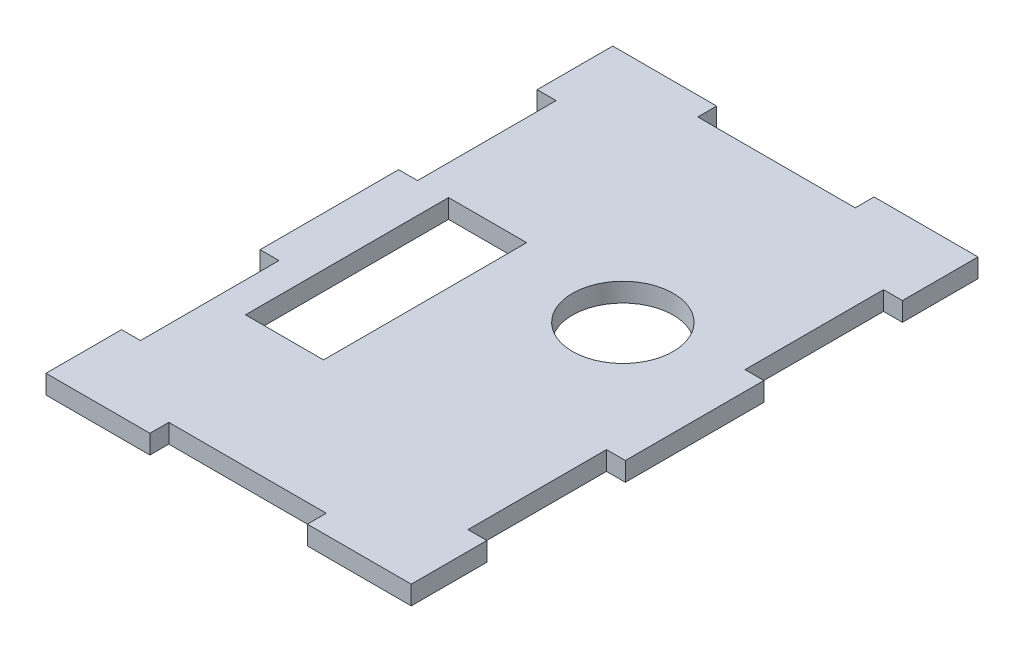
ISO-10303-21;
HEADER;
FILE_DESCRIPTION(('STEP AP214'),'2;1');
FILE_NAME('part.step','',(''),(''),'','','');
FILE_SCHEMA(('AUTOMOTIVE_DESIGN { 1 0 10303 214 1 1 1 1 }'));
ENDSEC;
DATA;
#1=APPLICATION_CONTEXT('core data for automotive mechanical design processes');
#2=APPLICATION_PROTOCOL_DEFINITION('international standard','automotive_design',2000,#1);
#3=PRODUCT_CONTEXT('',#1,'mechanical');
#4=PRODUCT('Part','Part','',(#3));
#5=PRODUCT_RELATED_PRODUCT_CATEGORY('part','',(#4));
#6=PRODUCT_DEFINITION_FORMATION('','',#4);
#7=PRODUCT_DEFINITION_CONTEXT('part definition',#1,'design');
#8=PRODUCT_DEFINITION('design','',#6,#7);
#9=PRODUCT_DEFINITION_SHAPE('','',#8);
#10=(LENGTH_UNIT() NAMED_UNIT(*) SI_UNIT(.MILLI.,.METRE.));
#11=(NAMED_UNIT(*) PLANE_ANGLE_UNIT() SI_UNIT($,.RADIAN.));
#12=(NAMED_UNIT(*) SI_UNIT($,.STERADIAN.) SOLID_ANGLE_UNIT());
#13=UNCERTAINTY_MEASURE_WITH_UNIT(LENGTH_MEASURE(1.E-05),#10,'distance_accuracy_value','');
#14=(GEOMETRIC_REPRESENTATION_CONTEXT(3) GLOBAL_UNCERTAINTY_ASSIGNED_CONTEXT((#13)) GLOBAL_UNIT_ASSIGNED_CONTEXT((#10,
#11,#12)) REPRESENTATION_CONTEXT('',''));
#15=CARTESIAN_POINT('',(0.,0.,0.));
#16=DIRECTION('',(0.,0.,1.));
#17=DIRECTION('',(1.,0.,0.));
#18=AXIS2_PLACEMENT_3D('',#15,#16,#17);
#19=CARTESIAN_POINT('',(0.,3.,0.));
#20=DIRECTION('',(0.,-1.,0.));
#21=DIRECTION('',(0.,0.,-1.));
#22=AXIS2_PLACEMENT_3D('',#19,#20,#21);
#23=PLANE('',#22);
#24=DIRECTION('',(1.,0.,0.));
#25=VECTOR('',#24,1.);
#26=CARTESIAN_POINT('',(-26.,3.,12.));
#27=LINE('',#26,#25);
#28=CARTESIAN_POINT('',(-26.,3.,12.));
#29=VERTEX_POINT('',#28);
#30=CARTESIAN_POINT('',(-23.,3.,12.));
#31=VERTEX_POINT('',#30);
#32=EDGE_CURVE('E281',#29,#31,#27,.T.);
#33=ORIENTED_EDGE('',*,*,#32,.T.);
#34=DIRECTION('',(0.,0.,1.));
#35=VECTOR('',#34,1.);
#36=CARTESIAN_POINT('',(-23.,3.,12.));
#37=LINE('',#36,#35);
#38=CARTESIAN_POINT('',(-23.,3.,34.));
#39=VERTEX_POINT('',#38);
#40=EDGE_CURVE('E284',#31,#39,#37,.T.);
#41=ORIENTED_EDGE('',*,*,#40,.T.);
#42=DIRECTION('',(-1.,0.,0.));
#43=VECTOR('',#42,1.);
#44=CARTESIAN_POINT('',(-23.,3.,34.));
#45=LINE('',#44,#43);
#46=CARTESIAN_POINT('',(-26.,3.,34.));
#47=VERTEX_POINT('',#46);
#48=EDGE_CURVE('E287',#39,#47,#45,.T.);
#49=ORIENTED_EDGE('',*,*,#48,.T.);
#50=DIRECTION('',(0.,0.,1.));
#51=VECTOR('',#50,1.);
#52=CARTESIAN_POINT('',(-26.,3.,34.));
#53=LINE('',#52,#51);
#54=CARTESIAN_POINT('',(-26.,3.,56.));
#55=VERTEX_POINT('',#54);
#56=EDGE_CURVE('E289',#47,#55,#53,.T.);
#57=ORIENTED_EDGE('',*,*,#56,.T.);
#58=DIRECTION('',(1.,0.,0.));
#59=VECTOR('',#58,1.);
#60=CARTESIAN_POINT('',(-26.,3.,56.));
#61=LINE('',#60,#59);
#62=CARTESIAN_POINT('',(-23.,3.,56.));
#63=VERTEX_POINT('',#62);
#64=EDGE_CURVE('E291',#55,#63,#61,.T.);
#65=ORIENTED_EDGE('',*,*,#64,.T.);
#66=DIRECTION('',(0.,0.,1.));
#67=VECTOR('',#66,1.);
#68=CARTESIAN_POINT('',(-23.,3.,56.));
#69=LINE('',#68,#67);
#70=CARTESIAN_POINT('',(-23.,3.,78.));
#71=VERTEX_POINT('',#70);
#72=EDGE_CURVE('E293',#63,#71,#69,.T.);
#73=ORIENTED_EDGE('',*,*,#72,.T.);
#74=DIRECTION('',(-1.,0.,0.));
#75=VECTOR('',#74,1.);
#76=CARTESIAN_POINT('',(-23.,3.,78.));
#77=LINE('',#76,#75);
#78=CARTESIAN_POINT('',(-26.,3.,78.));
#79=VERTEX_POINT('',#78);
#80=EDGE_CURVE('E295',#71,#79,#77,.T.);
#81=ORIENTED_EDGE('',*,*,#80,.T.);
#82=DIRECTION('',(0.,0.,1.));
#83=VECTOR('',#82,1.);
#84=CARTESIAN_POINT('',(-26.,3.,78.));
#85=LINE('',#84,#83);
#86=CARTESIAN_POINT('',(-26.,3.,90.));
#87=VERTEX_POINT('',#86);
#88=EDGE_CURVE('E297',#79,#87,#85,.T.);
#89=ORIENTED_EDGE('',*,*,#88,.T.);
#90=DIRECTION('',(1.,0.,0.));
#91=VECTOR('',#90,1.);
#92=CARTESIAN_POINT('',(-26.,3.,90.));
#93=LINE('',#92,#91);
#94=CARTESIAN_POINT('',(-9.49999999999999,3.,90.));
#95=VERTEX_POINT('',#94);
#96=EDGE_CURVE('E299',#87,#95,#93,.T.);
#97=ORIENTED_EDGE('',*,*,#96,.T.);
#98=DIRECTION('',(0.,0.,-1.));
#99=VECTOR('',#98,1.);
#100=CARTESIAN_POINT('',(-9.49999999999999,3.,90.));
#101=LINE('',#100,#99);
#102=CARTESIAN_POINT('',(-9.5,3.,87.));
#103=VERTEX_POINT('',#102);
#104=EDGE_CURVE('E301',#95,#103,#101,.T.);
#105=ORIENTED_EDGE('',*,*,#104,.T.);
#106=DIRECTION('',(1.,0.,0.));
#107=VECTOR('',#106,1.);
#108=CARTESIAN_POINT('',(-9.5,3.,87.));
#109=LINE('',#108,#107);
#110=CARTESIAN_POINT('',(15.5,3.,87.));
#111=VERTEX_POINT('',#110);
#112=EDGE_CURVE('E303',#103,#111,#109,.T.);
#113=ORIENTED_EDGE('',*,*,#112,.T.);
#114=DIRECTION('',(0.,0.,1.));
#115=VECTOR('',#114,1.);
#116=CARTESIAN_POINT('',(15.5,3.,87.));
#117=LINE('',#116,#115);
#118=CARTESIAN_POINT('',(15.5,3.,90.));
#119=VERTEX_POINT('',#118);
#120=EDGE_CURVE('E305',#111,#119,#117,.T.);
#121=ORIENTED_EDGE('',*,*,#120,.T.);
#122=DIRECTION('',(1.,0.,0.));
#123=VECTOR('',#122,1.);
#124=CARTESIAN_POINT('',(15.5,3.,90.));
#125=LINE('',#124,#123);
#126=CARTESIAN_POINT('',(32.,3.,90.));
#127=VERTEX_POINT('',#126);
#128=EDGE_CURVE('E307',#119,#127,#125,.T.);
#129=ORIENTED_EDGE('',*,*,#128,.T.);
#130=DIRECTION('',(0.,0.,-1.));
#131=VECTOR('',#130,1.);
#132=CARTESIAN_POINT('',(32.,3.,78.));
#133=LINE('',#132,#131);
#134=CARTESIAN_POINT('',(32.,3.,78.));
#135=VERTEX_POINT('',#134);
#136=EDGE_CURVE('E309',#127,#135,#133,.T.);
#137=ORIENTED_EDGE('',*,*,#136,.T.);
#138=DIRECTION('',(-1.,0.,0.));
#139=VECTOR('',#138,1.);
#140=CARTESIAN_POINT('',(32.,3.,78.));
#141=LINE('',#140,#139);
#142=CARTESIAN_POINT('',(29.,3.,78.));
#143=VERTEX_POINT('',#142);
#144=EDGE_CURVE('E311',#135,#143,#141,.T.);
#145=ORIENTED_EDGE('',*,*,#144,.T.);
#146=DIRECTION('',(0.,0.,-1.));
#147=VECTOR('',#146,1.);
#148=CARTESIAN_POINT('',(29.,3.,78.));
#149=LINE('',#148,#147);
#150=CARTESIAN_POINT('',(29.,3.,56.));
#151=VERTEX_POINT('',#150);
#152=EDGE_CURVE('E313',#143,#151,#149,.T.);
#153=ORIENTED_EDGE('',*,*,#152,.T.);
#154=DIRECTION('',(1.,0.,0.));
#155=VECTOR('',#154,1.);
#156=CARTESIAN_POINT('',(29.,3.,56.));
#157=LINE('',#156,#155);
#158=CARTESIAN_POINT('',(32.,3.,56.));
#159=VERTEX_POINT('',#158);
#160=EDGE_CURVE('E315',#151,#159,#157,.T.);
#161=ORIENTED_EDGE('',*,*,#160,.T.);
#162=DIRECTION('',(0.,0.,-1.));
#163=VECTOR('',#162,1.);
#164=CARTESIAN_POINT('',(32.,3.,34.));
#165=LINE('',#164,#163);
#166=CARTESIAN_POINT('',(32.,3.,34.));
#167=VERTEX_POINT('',#166);
#168=EDGE_CURVE('E317',#159,#167,#165,.T.);
#169=ORIENTED_EDGE('',*,*,#168,.T.);
#170=DIRECTION('',(-1.,0.,0.));
#171=VECTOR('',#170,1.);
#172=CARTESIAN_POINT('',(29.,3.,34.));
#173=LINE('',#172,#171);
#174=CARTESIAN_POINT('',(29.,3.,34.));
#175=VERTEX_POINT('',#174);
#176=EDGE_CURVE('E319',#167,#175,#173,.T.);
#177=ORIENTED_EDGE('',*,*,#176,.T.);
#178=DIRECTION('',(0.,0.,-1.));
#179=VECTOR('',#178,1.);
#180=CARTESIAN_POINT('',(29.,3.,12.));
#181=LINE('',#180,#179);
#182=CARTESIAN_POINT('',(29.,3.,12.));
#183=VERTEX_POINT('',#182);
#184=EDGE_CURVE('E321',#175,#183,#181,.T.);
#185=ORIENTED_EDGE('',*,*,#184,.T.);
#186=DIRECTION('',(1.,0.,0.));
#187=VECTOR('',#186,1.);
#188=CARTESIAN_POINT('',(32.,3.,12.));
#189=LINE('',#188,#187);
#190=CARTESIAN_POINT('',(32.,3.,12.));
#191=VERTEX_POINT('',#190);
#192=EDGE_CURVE('E323',#183,#191,#189,.T.);
#193=ORIENTED_EDGE('',*,*,#192,.T.);
#194=DIRECTION('',(0.,0.,-1.));
#195=VECTOR('',#194,1.);
#196=CARTESIAN_POINT('',(32.,3.,0.));
#197=LINE('',#196,#195);
#198=CARTESIAN_POINT('',(32.,3.,0.));
#199=VERTEX_POINT('',#198);
#200=EDGE_CURVE('E325',#191,#199,#197,.T.);
#201=ORIENTED_EDGE('',*,*,#200,.T.);
#202=DIRECTION('',(-1.,0.,0.));
#203=VECTOR('',#202,1.);
#204=CARTESIAN_POINT('',(15.5,3.,0.));
#205=LINE('',#204,#203);
#206=CARTESIAN_POINT('',(15.5,3.,0.));
#207=VERTEX_POINT('',#206);
#208=EDGE_CURVE('E327',#199,#207,#205,.T.);
#209=ORIENTED_EDGE('',*,*,#208,.T.);
#210=DIRECTION('',(0.,0.,1.));
#211=VECTOR('',#210,1.);
#212=CARTESIAN_POINT('',(15.5,3.,3.));
#213=LINE('',#212,#211);
#214=CARTESIAN_POINT('',(15.5,3.,3.));
#215=VERTEX_POINT('',#214);
#216=EDGE_CURVE('E329',#207,#215,#213,.T.);
#217=ORIENTED_EDGE('',*,*,#216,.T.);
#218=DIRECTION('',(-1.,0.,0.));
#219=VECTOR('',#218,1.);
#220=CARTESIAN_POINT('',(-9.5,3.,3.));
#221=LINE('',#220,#219);
#222=CARTESIAN_POINT('',(-9.5,3.,3.));
#223=VERTEX_POINT('',#222);
#224=EDGE_CURVE('E331',#215,#223,#221,.T.);
#225=ORIENTED_EDGE('',*,*,#224,.T.);
#226=DIRECTION('',(0.,0.,-1.));
#227=VECTOR('',#226,1.);
#228=CARTESIAN_POINT('',(-9.5,3.,0.));
#229=LINE('',#228,#227);
#230=CARTESIAN_POINT('',(-9.5,3.,0.));
#231=VERTEX_POINT('',#230);
#232=EDGE_CURVE('E333',#223,#231,#229,.T.);
#233=ORIENTED_EDGE('',*,*,#232,.T.);
#234=DIRECTION('',(-1.,0.,0.));
#235=VECTOR('',#234,1.);
#236=CARTESIAN_POINT('',(-26.,3.,0.));
#237=LINE('',#236,#235);
#238=CARTESIAN_POINT('',(-26.,3.,0.));
#239=VERTEX_POINT('',#238);
#240=EDGE_CURVE('E335',#231,#239,#237,.T.);
#241=ORIENTED_EDGE('',*,*,#240,.T.);
#242=DIRECTION('',(0.,0.,1.));
#243=VECTOR('',#242,1.);
#244=CARTESIAN_POINT('',(-26.,3.,0.));
#245=LINE('',#244,#243);
#246=EDGE_CURVE('E337',#239,#29,#245,.T.);
#247=ORIENTED_EDGE('',*,*,#246,.T.);
#248=EDGE_LOOP('',(#33,#41,#49,#57,#65,#73,#81,#89,#97,#105,#113,#121,#129,#137,#145,#153,#161,
#169,#177,#185,#193,#201,#209,#217,#225,#233,#241,#247));
#249=FACE_BOUND('',#248,.T.);
#250=DIRECTION('',(-1.,0.,0.));
#251=VECTOR('',#250,1.);
#252=CARTESIAN_POINT('',(-18.2,3.,33.875));
#253=LINE('',#252,#251);
#254=CARTESIAN_POINT('',(-5.79999999999999,3.,33.875));
#255=VERTEX_POINT('',#254);
#256=CARTESIAN_POINT('',(-18.2,3.,33.875));
#257=VERTEX_POINT('',#256);
#258=EDGE_CURVE('E242',#255,#257,#253,.T.);
#259=ORIENTED_EDGE('',*,*,#258,.F.);
#260=DIRECTION('',(0.,0.,-1.));
#261=VECTOR('',#260,1.);
#262=CARTESIAN_POINT('',(-5.79999999999999,3.,66.125));
#263=LINE('',#262,#261);
#264=CARTESIAN_POINT('',(-5.79999999999999,3.,66.125));
#265=VERTEX_POINT('',#264);
#266=EDGE_CURVE('E265',#265,#255,#263,.T.);
#267=ORIENTED_EDGE('',*,*,#266,.F.);
#268=DIRECTION('',(1.,0.,0.));
#269=VECTOR('',#268,1.);
#270=CARTESIAN_POINT('',(-18.2,3.,66.125));
#271=LINE('',#270,#269);
#272=CARTESIAN_POINT('',(-18.2,3.,66.125));
#273=VERTEX_POINT('',#272);
#274=EDGE_CURVE('E263',#273,#265,#271,.T.);
#275=ORIENTED_EDGE('',*,*,#274,.F.);
#276=DIRECTION('',(0.,0.,1.));
#277=VECTOR('',#276,1.);
#278=CARTESIAN_POINT('',(-18.2,3.,33.875));
#279=LINE('',#278,#277);
#280=EDGE_CURVE('E250',#257,#273,#279,.T.);
#281=ORIENTED_EDGE('',*,*,#280,.F.);
#282=EDGE_LOOP('',(#259,#267,#275,#281));
#283=FACE_BOUND('',#282,.T.);
#284=CARTESIAN_POINT('',(12.8024192368406,3.,37.2));
#285=DIRECTION('',(0.,1.,0.));
#286=DIRECTION('',(0.,0.,1.));
#287=AXIS2_PLACEMENT_3D('',#284,#285,#286);
#288=CIRCLE('',#287,8.);
#289=CARTESIAN_POINT('',(12.8024192368406,3.,45.2));
#290=VERTEX_POINT('',#289);
#291=EDGE_CURVE('E271',#290,#290,#288,.T.);
#292=ORIENTED_EDGE('',*,*,#291,.F.);
#293=EDGE_LOOP('',(#292));
#294=FACE_BOUND('',#293,.T.);
#295=ADVANCED_FACE('F33',(#249,#283,#294),#23,.F.);
#296=CARTESIAN_POINT('',(0.,0.,0.));
#297=DIRECTION('',(0.,-1.,0.));
#298=DIRECTION('',(0.,0.,-1.));
#299=AXIS2_PLACEMENT_3D('',#296,#297,#298);
#300=PLANE('',#299);
#301=DIRECTION('',(0.,0.,-1.));
#302=VECTOR('',#301,1.);
#303=CARTESIAN_POINT('',(-5.79999999999999,0.,66.125));
#304=LINE('',#303,#302);
#305=CARTESIAN_POINT('',(-5.79999999999999,0.,66.125));
#306=VERTEX_POINT('',#305);
#307=CARTESIAN_POINT('',(-5.79999999999999,0.,33.875));
#308=VERTEX_POINT('',#307);
#309=EDGE_CURVE('E251',#306,#308,#304,.T.);
#310=ORIENTED_EDGE('',*,*,#309,.T.);
#311=DIRECTION('',(-1.,0.,0.));
#312=VECTOR('',#311,1.);
#313=CARTESIAN_POINT('',(-18.2,0.,33.875));
#314=LINE('',#313,#312);
#315=CARTESIAN_POINT('',(-18.2,0.,33.875));
#316=VERTEX_POINT('',#315);
#317=EDGE_CURVE('E56',#308,#316,#314,.T.);
#318=ORIENTED_EDGE('',*,*,#317,.T.);
#319=DIRECTION('',(0.,0.,1.));
#320=VECTOR('',#319,1.);
#321=CARTESIAN_POINT('',(-18.2,0.,33.875));
#322=LINE('',#321,#320);
#323=CARTESIAN_POINT('',(-18.2,0.,66.125));
#324=VERTEX_POINT('',#323);
#325=EDGE_CURVE('E257',#316,#324,#322,.T.);
#326=ORIENTED_EDGE('',*,*,#325,.T.);
#327=DIRECTION('',(1.,0.,0.));
#328=VECTOR('',#327,1.);
#329=CARTESIAN_POINT('',(-18.2,0.,66.125));
#330=LINE('',#329,#328);
#331=EDGE_CURVE('E273',#324,#306,#330,.T.);
#332=ORIENTED_EDGE('',*,*,#331,.T.);
#333=EDGE_LOOP('',(#310,#318,#326,#332));
#334=FACE_BOUND('',#333,.T.);
#335=DIRECTION('',(1.,0.,0.));
#336=VECTOR('',#335,1.);
#337=CARTESIAN_POINT('',(-26.,0.,12.));
#338=LINE('',#337,#336);
#339=CARTESIAN_POINT('',(-26.,0.,12.));
#340=VERTEX_POINT('',#339);
#341=CARTESIAN_POINT('',(-23.,0.,12.));
#342=VERTEX_POINT('',#341);
#343=EDGE_CURVE('E258',#340,#342,#338,.T.);
#344=ORIENTED_EDGE('',*,*,#343,.F.);
#345=DIRECTION('',(0.,0.,1.));
#346=VECTOR('',#345,1.);
#347=CARTESIAN_POINT('',(-26.,0.,0.));
#348=LINE('',#347,#346);
#349=CARTESIAN_POINT('',(-26.,0.,0.));
#350=VERTEX_POINT('',#349);
#351=EDGE_CURVE('E285',#350,#340,#348,.T.);
#352=ORIENTED_EDGE('',*,*,#351,.F.);
#353=DIRECTION('',(-1.,0.,0.));
#354=VECTOR('',#353,1.);
#355=CARTESIAN_POINT('',(-26.,0.,0.));
#356=LINE('',#355,#354);
#357=CARTESIAN_POINT('',(-9.5,0.,0.));
#358=VERTEX_POINT('',#357);
#359=EDGE_CURVE('E392',#358,#350,#356,.T.);
#360=ORIENTED_EDGE('',*,*,#359,.F.);
#361=DIRECTION('',(0.,0.,-1.));
#362=VECTOR('',#361,1.);
#363=CARTESIAN_POINT('',(-9.5,0.,0.));
#364=LINE('',#363,#362);
#365=CARTESIAN_POINT('',(-9.5,0.,3.));
#366=VERTEX_POINT('',#365);
#367=EDGE_CURVE('E390',#366,#358,#364,.T.);
#368=ORIENTED_EDGE('',*,*,#367,.F.);
#369=DIRECTION('',(-1.,0.,0.));
#370=VECTOR('',#369,1.);
#371=CARTESIAN_POINT('',(-9.5,0.,3.));
#372=LINE('',#371,#370);
#373=CARTESIAN_POINT('',(15.5,0.,3.));
#374=VERTEX_POINT('',#373);
#375=EDGE_CURVE('E388',#374,#366,#372,.T.);
#376=ORIENTED_EDGE('',*,*,#375,.F.);
#377=DIRECTION('',(0.,0.,1.));
#378=VECTOR('',#377,1.);
#379=CARTESIAN_POINT('',(15.5,0.,3.));
#380=LINE('',#379,#378);
#381=CARTESIAN_POINT('',(15.5,0.,0.));
#382=VERTEX_POINT('',#381);
#383=EDGE_CURVE('E386',#382,#374,#380,.T.);
#384=ORIENTED_EDGE('',*,*,#383,.F.);
#385=DIRECTION('',(-1.,0.,0.));
#386=VECTOR('',#385,1.);
#387=CARTESIAN_POINT('',(15.5,0.,0.));
#388=LINE('',#387,#386);
#389=CARTESIAN_POINT('',(32.,0.,0.));
#390=VERTEX_POINT('',#389);
#391=EDGE_CURVE('E384',#390,#382,#388,.T.);
#392=ORIENTED_EDGE('',*,*,#391,.F.);
#393=DIRECTION('',(0.,0.,-1.));
#394=VECTOR('',#393,1.);
#395=CARTESIAN_POINT('',(32.,0.,0.));
#396=LINE('',#395,#394);
#397=CARTESIAN_POINT('',(32.,0.,12.));
#398=VERTEX_POINT('',#397);
#399=EDGE_CURVE('E382',#398,#390,#396,.T.);
#400=ORIENTED_EDGE('',*,*,#399,.F.);
#401=DIRECTION('',(1.,0.,0.));
#402=VECTOR('',#401,1.);
#403=CARTESIAN_POINT('',(32.,0.,12.));
#404=LINE('',#403,#402);
#405=CARTESIAN_POINT('',(29.,0.,12.));
#406=VERTEX_POINT('',#405);
#407=EDGE_CURVE('E380',#406,#398,#404,.T.);
#408=ORIENTED_EDGE('',*,*,#407,.F.);
#409=DIRECTION('',(0.,0.,-1.));
#410=VECTOR('',#409,1.);
#411=CARTESIAN_POINT('',(29.,0.,12.));
#412=LINE('',#411,#410);
#413=CARTESIAN_POINT('',(29.,0.,34.));
#414=VERTEX_POINT('',#413);
#415=EDGE_CURVE('E378',#414,#406,#412,.T.);
#416=ORIENTED_EDGE('',*,*,#415,.F.);
#417=DIRECTION('',(-1.,0.,0.));
#418=VECTOR('',#417,1.);
#419=CARTESIAN_POINT('',(29.,0.,34.));
#420=LINE('',#419,#418);
#421=CARTESIAN_POINT('',(32.,0.,34.));
#422=VERTEX_POINT('',#421);
#423=EDGE_CURVE('E376',#422,#414,#420,.T.);
#424=ORIENTED_EDGE('',*,*,#423,.F.);
#425=DIRECTION('',(0.,0.,-1.));
#426=VECTOR('',#425,1.);
#427=CARTESIAN_POINT('',(32.,0.,34.));
#428=LINE('',#427,#426);
#429=CARTESIAN_POINT('',(32.,0.,56.));
#430=VERTEX_POINT('',#429);
#431=EDGE_CURVE('E374',#430,#422,#428,.T.);
#432=ORIENTED_EDGE('',*,*,#431,.F.);
#433=DIRECTION('',(1.,0.,0.));
#434=VECTOR('',#433,1.);
#435=CARTESIAN_POINT('',(29.,0.,56.));
#436=LINE('',#435,#434);
#437=CARTESIAN_POINT('',(29.,0.,56.));
#438=VERTEX_POINT('',#437);
#439=EDGE_CURVE('E372',#438,#430,#436,.T.);
#440=ORIENTED_EDGE('',*,*,#439,.F.);
#441=DIRECTION('',(0.,0.,-1.));
#442=VECTOR('',#441,1.);
#443=CARTESIAN_POINT('',(29.,0.,78.));
#444=LINE('',#443,#442);
#445=CARTESIAN_POINT('',(29.,0.,78.));
#446=VERTEX_POINT('',#445);
#447=EDGE_CURVE('E370',#446,#438,#444,.T.);
#448=ORIENTED_EDGE('',*,*,#447,.F.);
#449=DIRECTION('',(-1.,0.,0.));
#450=VECTOR('',#449,1.);
#451=CARTESIAN_POINT('',(32.,0.,78.));
#452=LINE('',#451,#450);
#453=CARTESIAN_POINT('',(32.,0.,78.));
#454=VERTEX_POINT('',#453);
#455=EDGE_CURVE('E368',#454,#446,#452,.T.);
#456=ORIENTED_EDGE('',*,*,#455,.F.);
#457=DIRECTION('',(0.,0.,-1.));
#458=VECTOR('',#457,1.);
#459=CARTESIAN_POINT('',(32.,0.,78.));
#460=LINE('',#459,#458);
#461=CARTESIAN_POINT('',(32.,0.,90.));
#462=VERTEX_POINT('',#461);
#463=EDGE_CURVE('E366',#462,#454,#460,.T.);
#464=ORIENTED_EDGE('',*,*,#463,.F.);
#465=DIRECTION('',(1.,0.,0.));
#466=VECTOR('',#465,1.);
#467=CARTESIAN_POINT('',(15.5,0.,90.));
#468=LINE('',#467,#466);
#469=CARTESIAN_POINT('',(15.5,0.,90.));
#470=VERTEX_POINT('',#469);
#471=EDGE_CURVE('E364',#470,#462,#468,.T.);
#472=ORIENTED_EDGE('',*,*,#471,.F.);
#473=DIRECTION('',(0.,0.,1.));
#474=VECTOR('',#473,1.);
#475=CARTESIAN_POINT('',(15.5,0.,87.));
#476=LINE('',#475,#474);
#477=CARTESIAN_POINT('',(15.5,0.,87.));
#478=VERTEX_POINT('',#477);
#479=EDGE_CURVE('E362',#478,#470,#476,.T.);
#480=ORIENTED_EDGE('',*,*,#479,.F.);
#481=DIRECTION('',(1.,0.,0.));
#482=VECTOR('',#481,1.);
#483=CARTESIAN_POINT('',(-9.5,0.,87.));
#484=LINE('',#483,#482);
#485=CARTESIAN_POINT('',(-9.5,0.,87.));
#486=VERTEX_POINT('',#485);
#487=EDGE_CURVE('E360',#486,#478,#484,.T.);
#488=ORIENTED_EDGE('',*,*,#487,.F.);
#489=DIRECTION('',(0.,0.,-1.));
#490=VECTOR('',#489,1.);
#491=CARTESIAN_POINT('',(-9.49999999999999,0.,90.));
#492=LINE('',#491,#490);
#493=CARTESIAN_POINT('',(-9.49999999999999,0.,90.));
#494=VERTEX_POINT('',#493);
#495=EDGE_CURVE('E358',#494,#486,#492,.T.);
#496=ORIENTED_EDGE('',*,*,#495,.F.);
#497=DIRECTION('',(1.,0.,0.));
#498=VECTOR('',#497,1.);
#499=CARTESIAN_POINT('',(-26.,0.,90.));
#500=LINE('',#499,#498);
#501=CARTESIAN_POINT('',(-26.,0.,90.));
#502=VERTEX_POINT('',#501);
#503=EDGE_CURVE('E356',#502,#494,#500,.T.);
#504=ORIENTED_EDGE('',*,*,#503,.F.);
#505=DIRECTION('',(0.,0.,1.));
#506=VECTOR('',#505,1.);
#507=CARTESIAN_POINT('',(-26.,0.,78.));
#508=LINE('',#507,#506);
#509=CARTESIAN_POINT('',(-26.,0.,78.));
#510=VERTEX_POINT('',#509);
#511=EDGE_CURVE('E354',#510,#502,#508,.T.);
#512=ORIENTED_EDGE('',*,*,#511,.F.);
#513=DIRECTION('',(-1.,0.,0.));
#514=VECTOR('',#513,1.);
#515=CARTESIAN_POINT('',(-23.,0.,78.));
#516=LINE('',#515,#514);
#517=CARTESIAN_POINT('',(-23.,0.,78.));
#518=VERTEX_POINT('',#517);
#519=EDGE_CURVE('E352',#518,#510,#516,.T.);
#520=ORIENTED_EDGE('',*,*,#519,.F.);
#521=DIRECTION('',(0.,0.,1.));
#522=VECTOR('',#521,1.);
#523=CARTESIAN_POINT('',(-23.,0.,56.));
#524=LINE('',#523,#522);
#525=CARTESIAN_POINT('',(-23.,0.,56.));
#526=VERTEX_POINT('',#525);
#527=EDGE_CURVE('E350',#526,#518,#524,.T.);
#528=ORIENTED_EDGE('',*,*,#527,.F.);
#529=DIRECTION('',(1.,0.,0.));
#530=VECTOR('',#529,1.);
#531=CARTESIAN_POINT('',(-26.,0.,56.));
#532=LINE('',#531,#530);
#533=CARTESIAN_POINT('',(-26.,0.,56.));
#534=VERTEX_POINT('',#533);
#535=EDGE_CURVE('E348',#534,#526,#532,.T.);
#536=ORIENTED_EDGE('',*,*,#535,.F.);
#537=DIRECTION('',(0.,0.,1.));
#538=VECTOR('',#537,1.);
#539=CARTESIAN_POINT('',(-26.,0.,34.));
#540=LINE('',#539,#538);
#541=CARTESIAN_POINT('',(-26.,0.,34.));
#542=VERTEX_POINT('',#541);
#543=EDGE_CURVE('E346',#542,#534,#540,.T.);
#544=ORIENTED_EDGE('',*,*,#543,.F.);
#545=DIRECTION('',(-1.,0.,0.));
#546=VECTOR('',#545,1.);
#547=CARTESIAN_POINT('',(-23.,0.,34.));
#548=LINE('',#547,#546);
#549=CARTESIAN_POINT('',(-23.,0.,34.));
#550=VERTEX_POINT('',#549);
#551=EDGE_CURVE('E344',#550,#542,#548,.T.);
#552=ORIENTED_EDGE('',*,*,#551,.F.);
#553=DIRECTION('',(0.,0.,1.));
#554=VECTOR('',#553,1.);
#555=CARTESIAN_POINT('',(-23.,0.,12.));
#556=LINE('',#555,#554);
#557=EDGE_CURVE('E342',#342,#550,#556,.T.);
#558=ORIENTED_EDGE('',*,*,#557,.F.);
#559=EDGE_LOOP('',(#344,#352,#360,#368,#376,#384,#392,#400,#408,#416,#424,#432,#440,#448,#456,
#464,#472,#480,#488,#496,#504,#512,#520,#528,#536,#544,#552,#558));
#560=FACE_BOUND('',#559,.T.);
#561=CARTESIAN_POINT('',(12.8024192368406,0.,37.2));
#562=DIRECTION('',(0.,1.,0.));
#563=DIRECTION('',(0.,0.,1.));
#564=AXIS2_PLACEMENT_3D('',#561,#562,#563);
#565=CIRCLE('',#564,8.);
#566=CARTESIAN_POINT('',(12.8024192368406,0.,45.2));
#567=VERTEX_POINT('',#566);
#568=EDGE_CURVE('E902',#567,#567,#565,.T.);
#569=ORIENTED_EDGE('',*,*,#568,.T.);
#570=EDGE_LOOP('',(#569));
#571=FACE_BOUND('',#570,.T.);
#572=ADVANCED_FACE('F482',(#334,#560,#571),#300,.T.);
#573=CARTESIAN_POINT('',(-26.,3.,12.));
#574=DIRECTION('',(0.,0.,-1.));
#575=DIRECTION('',(-1.,0.,0.));
#576=AXIS2_PLACEMENT_3D('',#573,#574,#575);
#577=PLANE('',#576);
#578=ORIENTED_EDGE('',*,*,#343,.T.);
#579=DIRECTION('',(0.,-1.,0.));
#580=VECTOR('',#579,1.);
#581=CARTESIAN_POINT('',(-23.,3.,12.));
#582=LINE('',#581,#580);
#583=EDGE_CURVE('E11',#31,#342,#582,.T.);
#584=ORIENTED_EDGE('',*,*,#583,.F.);
#585=ORIENTED_EDGE('',*,*,#32,.F.);
#586=DIRECTION('',(0.,-1.,0.));
#587=VECTOR('',#586,1.);
#588=CARTESIAN_POINT('',(-26.,3.,12.));
#589=LINE('',#588,#587);
#590=EDGE_CURVE('E339',#29,#340,#589,.T.);
#591=ORIENTED_EDGE('',*,*,#590,.T.);
#592=EDGE_LOOP('',(#578,#584,#585,#591));
#593=FACE_BOUND('',#592,.T.);
#594=ADVANCED_FACE('F35',(#593),#577,.F.);
#595=CARTESIAN_POINT('',(-23.,3.,12.));
#596=DIRECTION('',(1.,0.,0.));
#597=DIRECTION('',(0.,0.,-1.));
#598=AXIS2_PLACEMENT_3D('',#595,#596,#597);
#599=PLANE('',#598);
#600=ORIENTED_EDGE('',*,*,#557,.T.);
#601=DIRECTION('',(0.,-1.,0.));
#602=VECTOR('',#601,1.);
#603=CARTESIAN_POINT('',(-23.,3.,34.));
#604=LINE('',#603,#602);
#605=EDGE_CURVE('E41',#39,#550,#604,.T.);
#606=ORIENTED_EDGE('',*,*,#605,.F.);
#607=ORIENTED_EDGE('',*,*,#40,.F.);
#608=ORIENTED_EDGE('',*,*,#583,.T.);
#609=EDGE_LOOP('',(#600,#606,#607,#608));
#610=FACE_BOUND('',#609,.T.);
#611=ADVANCED_FACE('F499',(#610),#599,.F.);
#612=CARTESIAN_POINT('',(-23.,3.,34.));
#613=DIRECTION('',(0.,0.,1.));
#614=DIRECTION('',(1.,0.,0.));
#615=AXIS2_PLACEMENT_3D('',#612,#613,#614);
#616=PLANE('',#615);
#617=ORIENTED_EDGE('',*,*,#551,.T.);
#618=DIRECTION('',(0.,-1.,0.));
#619=VECTOR('',#618,1.);
#620=CARTESIAN_POINT('',(-26.,3.,34.));
#621=LINE('',#620,#619);
#622=EDGE_CURVE('E469',#47,#542,#621,.T.);
#623=ORIENTED_EDGE('',*,*,#622,.F.);
#624=ORIENTED_EDGE('',*,*,#48,.F.);
#625=ORIENTED_EDGE('',*,*,#605,.T.);
#626=EDGE_LOOP('',(#617,#623,#624,#625));
#627=FACE_BOUND('',#626,.T.);
#628=ADVANCED_FACE('F476',(#627),#616,.F.);
#629=CARTESIAN_POINT('',(-26.,3.,34.));
#630=DIRECTION('',(1.,0.,0.));
#631=DIRECTION('',(0.,0.,-1.));
#632=AXIS2_PLACEMENT_3D('',#629,#630,#631);
#633=PLANE('',#632);
#634=ORIENTED_EDGE('',*,*,#543,.T.);
#635=DIRECTION('',(0.,-1.,0.));
#636=VECTOR('',#635,1.);
#637=CARTESIAN_POINT('',(-26.,3.,56.));
#638=LINE('',#637,#636);
#639=EDGE_CURVE('E466',#55,#534,#638,.T.);
#640=ORIENTED_EDGE('',*,*,#639,.F.);
#641=ORIENTED_EDGE('',*,*,#56,.F.);
#642=ORIENTED_EDGE('',*,*,#622,.T.);
#643=EDGE_LOOP('',(#634,#640,#641,#642));
#644=FACE_BOUND('',#643,.T.);
#645=ADVANCED_FACE('F488',(#644),#633,.F.);
#646=CARTESIAN_POINT('',(-26.,3.,56.));
#647=DIRECTION('',(0.,0.,-1.));
#648=DIRECTION('',(-1.,0.,0.));
#649=AXIS2_PLACEMENT_3D('',#646,#647,#648);
#650=PLANE('',#649);
#651=ORIENTED_EDGE('',*,*,#535,.T.);
#652=DIRECTION('',(0.,-1.,0.));
#653=VECTOR('',#652,1.);
#654=CARTESIAN_POINT('',(-23.,3.,56.));
#655=LINE('',#654,#653);
#656=EDGE_CURVE('E463',#63,#526,#655,.T.);
#657=ORIENTED_EDGE('',*,*,#656,.F.);
#658=ORIENTED_EDGE('',*,*,#64,.F.);
#659=ORIENTED_EDGE('',*,*,#639,.T.);
#660=EDGE_LOOP('',(#651,#657,#658,#659));
#661=FACE_BOUND('',#660,.T.);
#662=ADVANCED_FACE('F492',(#661),#650,.F.);
#663=CARTESIAN_POINT('',(-23.,3.,56.));
#664=DIRECTION('',(1.,0.,0.));
#665=DIRECTION('',(0.,0.,-1.));
#666=AXIS2_PLACEMENT_3D('',#663,#664,#665);
#667=PLANE('',#666);
#668=ORIENTED_EDGE('',*,*,#527,.T.);
#669=DIRECTION('',(0.,-1.,0.));
#670=VECTOR('',#669,1.);
#671=CARTESIAN_POINT('',(-23.,3.,78.));
#672=LINE('',#671,#670);
#673=EDGE_CURVE('E460',#71,#518,#672,.T.);
#674=ORIENTED_EDGE('',*,*,#673,.F.);
#675=ORIENTED_EDGE('',*,*,#72,.F.);
#676=ORIENTED_EDGE('',*,*,#656,.T.);
#677=EDGE_LOOP('',(#668,#674,#675,#676));
#678=FACE_BOUND('',#677,.T.);
#679=ADVANCED_FACE('F612',(#678),#667,.F.);
#680=CARTESIAN_POINT('',(-23.,3.,78.));
#681=DIRECTION('',(0.,0.,1.));
#682=DIRECTION('',(1.,0.,0.));
#683=AXIS2_PLACEMENT_3D('',#680,#681,#682);
#684=PLANE('',#683);
#685=ORIENTED_EDGE('',*,*,#519,.T.);
#686=DIRECTION('',(0.,-1.,0.));
#687=VECTOR('',#686,1.);
#688=CARTESIAN_POINT('',(-26.,3.,78.));
#689=LINE('',#688,#687);
#690=EDGE_CURVE('E457',#79,#510,#689,.T.);
#691=ORIENTED_EDGE('',*,*,#690,.F.);
#692=ORIENTED_EDGE('',*,*,#80,.F.);
#693=ORIENTED_EDGE('',*,*,#673,.T.);
#694=EDGE_LOOP('',(#685,#691,#692,#693));
#695=FACE_BOUND('',#694,.T.);
#696=ADVANCED_FACE('F609',(#695),#684,.F.);
#697=CARTESIAN_POINT('',(-26.,3.,78.));
#698=DIRECTION('',(1.,0.,0.));
#699=DIRECTION('',(0.,0.,-1.));
#700=AXIS2_PLACEMENT_3D('',#697,#698,#699);
#701=PLANE('',#700);
#702=ORIENTED_EDGE('',*,*,#511,.T.);
#703=DIRECTION('',(0.,-1.,0.));
#704=VECTOR('',#703,1.);
#705=CARTESIAN_POINT('',(-26.,3.,90.));
#706=LINE('',#705,#704);
#707=EDGE_CURVE('E454',#87,#502,#706,.T.);
#708=ORIENTED_EDGE('',*,*,#707,.F.);
#709=ORIENTED_EDGE('',*,*,#88,.F.);
#710=ORIENTED_EDGE('',*,*,#690,.T.);
#711=EDGE_LOOP('',(#702,#708,#709,#710));
#712=FACE_BOUND('',#711,.T.);
#713=ADVANCED_FACE('F605',(#712),#701,.F.);
#714=CARTESIAN_POINT('',(-26.,3.,90.));
#715=DIRECTION('',(0.,0.,-1.));
#716=DIRECTION('',(-1.,0.,0.));
#717=AXIS2_PLACEMENT_3D('',#714,#715,#716);
#718=PLANE('',#717);
#719=ORIENTED_EDGE('',*,*,#503,.T.);
#720=DIRECTION('',(0.,-1.,0.));
#721=VECTOR('',#720,1.);
#722=CARTESIAN_POINT('',(-9.49999999999999,3.,90.));
#723=LINE('',#722,#721);
#724=EDGE_CURVE('E451',#95,#494,#723,.T.);
#725=ORIENTED_EDGE('',*,*,#724,.F.);
#726=ORIENTED_EDGE('',*,*,#96,.F.);
#727=ORIENTED_EDGE('',*,*,#707,.T.);
#728=EDGE_LOOP('',(#719,#725,#726,#727));
#729=FACE_BOUND('',#728,.T.);
#730=ADVANCED_FACE('F601',(#729),#718,.F.);
#731=CARTESIAN_POINT('',(-9.49999999999999,3.,90.));
#732=DIRECTION('',(-1.,0.,0.));
#733=DIRECTION('',(0.,0.,1.));
#734=AXIS2_PLACEMENT_3D('',#731,#732,#733);
#735=PLANE('',#734);
#736=ORIENTED_EDGE('',*,*,#495,.T.);
#737=DIRECTION('',(0.,-1.,0.));
#738=VECTOR('',#737,1.);
#739=CARTESIAN_POINT('',(-9.5,3.,87.));
#740=LINE('',#739,#738);
#741=EDGE_CURVE('E448',#103,#486,#740,.T.);
#742=ORIENTED_EDGE('',*,*,#741,.F.);
#743=ORIENTED_EDGE('',*,*,#104,.F.);
#744=ORIENTED_EDGE('',*,*,#724,.T.);
#745=EDGE_LOOP('',(#736,#742,#743,#744));
#746=FACE_BOUND('',#745,.T.);
#747=ADVANCED_FACE('F596',(#746),#735,.F.);
#748=CARTESIAN_POINT('',(-9.5,3.,87.));
#749=DIRECTION('',(0.,0.,-1.));
#750=DIRECTION('',(-1.,0.,0.));
#751=AXIS2_PLACEMENT_3D('',#748,#749,#750);
#752=PLANE('',#751);
#753=ORIENTED_EDGE('',*,*,#487,.T.);
#754=DIRECTION('',(0.,-1.,0.));
#755=VECTOR('',#754,1.);
#756=CARTESIAN_POINT('',(15.5,3.,87.));
#757=LINE('',#756,#755);
#758=EDGE_CURVE('E445',#111,#478,#757,.T.);
#759=ORIENTED_EDGE('',*,*,#758,.F.);
#760=ORIENTED_EDGE('',*,*,#112,.F.);
#761=ORIENTED_EDGE('',*,*,#741,.T.);
#762=EDGE_LOOP('',(#753,#759,#760,#761));
#763=FACE_BOUND('',#762,.T.);
#764=ADVANCED_FACE('F590',(#763),#752,.F.);
#765=CARTESIAN_POINT('',(15.5,3.,87.));
#766=DIRECTION('',(1.,0.,0.));
#767=DIRECTION('',(0.,0.,-1.));
#768=AXIS2_PLACEMENT_3D('',#765,#766,#767);
#769=PLANE('',#768);
#770=ORIENTED_EDGE('',*,*,#479,.T.);
#771=DIRECTION('',(0.,-1.,0.));
#772=VECTOR('',#771,1.);
#773=CARTESIAN_POINT('',(15.5,3.,90.));
#774=LINE('',#773,#772);
#775=EDGE_CURVE('E442',#119,#470,#774,.T.);
#776=ORIENTED_EDGE('',*,*,#775,.F.);
#777=ORIENTED_EDGE('',*,*,#120,.F.);
#778=ORIENTED_EDGE('',*,*,#758,.T.);
#779=EDGE_LOOP('',(#770,#776,#777,#778));
#780=FACE_BOUND('',#779,.T.);
#781=ADVANCED_FACE('F586',(#780),#769,.F.);
#782=CARTESIAN_POINT('',(15.5,3.,90.));
#783=DIRECTION('',(0.,0.,-1.));
#784=DIRECTION('',(-1.,0.,0.));
#785=AXIS2_PLACEMENT_3D('',#782,#783,#784);
#786=PLANE('',#785);
#787=ORIENTED_EDGE('',*,*,#471,.T.);
#788=DIRECTION('',(0.,-1.,0.));
#789=VECTOR('',#788,1.);
#790=CARTESIAN_POINT('',(32.,3.,90.));
#791=LINE('',#790,#789);
#792=EDGE_CURVE('E439',#127,#462,#791,.T.);
#793=ORIENTED_EDGE('',*,*,#792,.F.);
#794=ORIENTED_EDGE('',*,*,#128,.F.);
#795=ORIENTED_EDGE('',*,*,#775,.T.);
#796=EDGE_LOOP('',(#787,#793,#794,#795));
#797=FACE_BOUND('',#796,.T.);
#798=ADVANCED_FACE('F581',(#797),#786,.F.);
#799=CARTESIAN_POINT('',(32.,3.,78.));
#800=DIRECTION('',(-1.,0.,0.));
#801=DIRECTION('',(0.,0.,1.));
#802=AXIS2_PLACEMENT_3D('',#799,#800,#801);
#803=PLANE('',#802);
#804=ORIENTED_EDGE('',*,*,#463,.T.);
#805=DIRECTION('',(0.,-1.,0.));
#806=VECTOR('',#805,1.);
#807=CARTESIAN_POINT('',(32.,3.,78.));
#808=LINE('',#807,#806);
#809=EDGE_CURVE('E436',#135,#454,#808,.T.);
#810=ORIENTED_EDGE('',*,*,#809,.F.);
#811=ORIENTED_EDGE('',*,*,#136,.F.);
#812=ORIENTED_EDGE('',*,*,#792,.T.);
#813=EDGE_LOOP('',(#804,#810,#811,#812));
#814=FACE_BOUND('',#813,.T.);
#815=ADVANCED_FACE('F575',(#814),#803,.F.);
#816=CARTESIAN_POINT('',(32.,3.,78.));
#817=DIRECTION('',(0.,0.,1.));
#818=DIRECTION('',(1.,0.,0.));
#819=AXIS2_PLACEMENT_3D('',#816,#817,#818);
#820=PLANE('',#819);
#821=ORIENTED_EDGE('',*,*,#455,.T.);
#822=DIRECTION('',(0.,-1.,0.));
#823=VECTOR('',#822,1.);
#824=CARTESIAN_POINT('',(29.,3.,78.));
#825=LINE('',#824,#823);
#826=EDGE_CURVE('E433',#143,#446,#825,.T.);
#827=ORIENTED_EDGE('',*,*,#826,.F.);
#828=ORIENTED_EDGE('',*,*,#144,.F.);
#829=ORIENTED_EDGE('',*,*,#809,.T.);
#830=EDGE_LOOP('',(#821,#827,#828,#829));
#831=FACE_BOUND('',#830,.T.);
#832=ADVANCED_FACE('F571',(#831),#820,.F.);
#833=CARTESIAN_POINT('',(29.,3.,78.));
#834=DIRECTION('',(-1.,0.,0.));
#835=DIRECTION('',(0.,0.,1.));
#836=AXIS2_PLACEMENT_3D('',#833,#834,#835);
#837=PLANE('',#836);
#838=ORIENTED_EDGE('',*,*,#447,.T.);
#839=DIRECTION('',(0.,-1.,0.));
#840=VECTOR('',#839,1.);
#841=CARTESIAN_POINT('',(29.,3.,56.));
#842=LINE('',#841,#840);
#843=EDGE_CURVE('E430',#151,#438,#842,.T.);
#844=ORIENTED_EDGE('',*,*,#843,.F.);
#845=ORIENTED_EDGE('',*,*,#152,.F.);
#846=ORIENTED_EDGE('',*,*,#826,.T.);
#847=EDGE_LOOP('',(#838,#844,#845,#846));
#848=FACE_BOUND('',#847,.T.);
#849=ADVANCED_FACE('F566',(#848),#837,.F.);
#850=CARTESIAN_POINT('',(29.,3.,56.));
#851=DIRECTION('',(0.,0.,-1.));
#852=DIRECTION('',(-1.,0.,0.));
#853=AXIS2_PLACEMENT_3D('',#850,#851,#852);
#854=PLANE('',#853);
#855=ORIENTED_EDGE('',*,*,#439,.T.);
#856=DIRECTION('',(0.,-1.,0.));
#857=VECTOR('',#856,1.);
#858=CARTESIAN_POINT('',(32.,3.,56.));
#859=LINE('',#858,#857);
#860=EDGE_CURVE('E427',#159,#430,#859,.T.);
#861=ORIENTED_EDGE('',*,*,#860,.F.);
#862=ORIENTED_EDGE('',*,*,#160,.F.);
#863=ORIENTED_EDGE('',*,*,#843,.T.);
#864=EDGE_LOOP('',(#855,#861,#862,#863));
#865=FACE_BOUND('',#864,.T.);
#866=ADVANCED_FACE('F560',(#865),#854,.F.);
#867=CARTESIAN_POINT('',(32.,3.,34.));
#868=DIRECTION('',(-1.,0.,0.));
#869=DIRECTION('',(0.,0.,1.));
#870=AXIS2_PLACEMENT_3D('',#867,#868,#869);
#871=PLANE('',#870);
#872=ORIENTED_EDGE('',*,*,#431,.T.);
#873=DIRECTION('',(0.,-1.,0.));
#874=VECTOR('',#873,1.);
#875=CARTESIAN_POINT('',(32.,3.,34.));
#876=LINE('',#875,#874);
#877=EDGE_CURVE('E424',#167,#422,#876,.T.);
#878=ORIENTED_EDGE('',*,*,#877,.F.);
#879=ORIENTED_EDGE('',*,*,#168,.F.);
#880=ORIENTED_EDGE('',*,*,#860,.T.);
#881=EDGE_LOOP('',(#872,#878,#879,#880));
#882=FACE_BOUND('',#881,.T.);
#883=ADVANCED_FACE('F556',(#882),#871,.F.);
#884=CARTESIAN_POINT('',(29.,3.,34.));
#885=DIRECTION('',(0.,0.,1.));
#886=DIRECTION('',(1.,0.,0.));
#887=AXIS2_PLACEMENT_3D('',#884,#885,#886);
#888=PLANE('',#887);
#889=ORIENTED_EDGE('',*,*,#423,.T.);
#890=DIRECTION('',(0.,-1.,0.));
#891=VECTOR('',#890,1.);
#892=CARTESIAN_POINT('',(29.,3.,34.));
#893=LINE('',#892,#891);
#894=EDGE_CURVE('E421',#175,#414,#893,.T.);
#895=ORIENTED_EDGE('',*,*,#894,.F.);
#896=ORIENTED_EDGE('',*,*,#176,.F.);
#897=ORIENTED_EDGE('',*,*,#877,.T.);
#898=EDGE_LOOP('',(#889,#895,#896,#897));
#899=FACE_BOUND('',#898,.T.);
#900=ADVANCED_FACE('F551',(#899),#888,.F.);
#901=CARTESIAN_POINT('',(29.,3.,12.));
#902=DIRECTION('',(-1.,0.,0.));
#903=DIRECTION('',(0.,0.,1.));
#904=AXIS2_PLACEMENT_3D('',#901,#902,#903);
#905=PLANE('',#904);
#906=ORIENTED_EDGE('',*,*,#415,.T.);
#907=DIRECTION('',(0.,-1.,0.));
#908=VECTOR('',#907,1.);
#909=CARTESIAN_POINT('',(29.,3.,12.));
#910=LINE('',#909,#908);
#911=EDGE_CURVE('E418',#183,#406,#910,.T.);
#912=ORIENTED_EDGE('',*,*,#911,.F.);
#913=ORIENTED_EDGE('',*,*,#184,.F.);
#914=ORIENTED_EDGE('',*,*,#894,.T.);
#915=EDGE_LOOP('',(#906,#912,#913,#914));
#916=FACE_BOUND('',#915,.T.);
#917=ADVANCED_FACE('F545',(#916),#905,.F.);
#918=CARTESIAN_POINT('',(32.,3.,12.));
#919=DIRECTION('',(0.,0.,-1.));
#920=DIRECTION('',(-1.,0.,0.));
#921=AXIS2_PLACEMENT_3D('',#918,#919,#920);
#922=PLANE('',#921);
#923=ORIENTED_EDGE('',*,*,#407,.T.);
#924=DIRECTION('',(0.,-1.,0.));
#925=VECTOR('',#924,1.);
#926=CARTESIAN_POINT('',(32.,3.,12.));
#927=LINE('',#926,#925);
#928=EDGE_CURVE('E415',#191,#398,#927,.T.);
#929=ORIENTED_EDGE('',*,*,#928,.F.);
#930=ORIENTED_EDGE('',*,*,#192,.F.);
#931=ORIENTED_EDGE('',*,*,#911,.T.);
#932=EDGE_LOOP('',(#923,#929,#930,#931));
#933=FACE_BOUND('',#932,.T.);
#934=ADVANCED_FACE('F541',(#933),#922,.F.);
#935=CARTESIAN_POINT('',(32.,3.,0.));
#936=DIRECTION('',(-1.,0.,0.));
#937=DIRECTION('',(0.,0.,1.));
#938=AXIS2_PLACEMENT_3D('',#935,#936,#937);
#939=PLANE('',#938);
#940=ORIENTED_EDGE('',*,*,#399,.T.);
#941=DIRECTION('',(0.,-1.,0.));
#942=VECTOR('',#941,1.);
#943=CARTESIAN_POINT('',(32.,3.,0.));
#944=LINE('',#943,#942);
#945=EDGE_CURVE('E412',#199,#390,#944,.T.);
#946=ORIENTED_EDGE('',*,*,#945,.F.);
#947=ORIENTED_EDGE('',*,*,#200,.F.);
#948=ORIENTED_EDGE('',*,*,#928,.T.);
#949=EDGE_LOOP('',(#940,#946,#947,#948));
#950=FACE_BOUND('',#949,.T.);
#951=ADVANCED_FACE('F536',(#950),#939,.F.);
#952=CARTESIAN_POINT('',(15.5,3.,0.));
#953=DIRECTION('',(0.,0.,1.));
#954=DIRECTION('',(1.,0.,0.));
#955=AXIS2_PLACEMENT_3D('',#952,#953,#954);
#956=PLANE('',#955);
#957=ORIENTED_EDGE('',*,*,#391,.T.);
#958=DIRECTION('',(0.,-1.,0.));
#959=VECTOR('',#958,1.);
#960=CARTESIAN_POINT('',(15.5,3.,0.));
#961=LINE('',#960,#959);
#962=EDGE_CURVE('E409',#207,#382,#961,.T.);
#963=ORIENTED_EDGE('',*,*,#962,.F.);
#964=ORIENTED_EDGE('',*,*,#208,.F.);
#965=ORIENTED_EDGE('',*,*,#945,.T.);
#966=EDGE_LOOP('',(#957,#963,#964,#965));
#967=FACE_BOUND('',#966,.T.);
#968=ADVANCED_FACE('F530',(#967),#956,.F.);
#969=CARTESIAN_POINT('',(15.5,3.,3.));
#970=DIRECTION('',(1.,0.,0.));
#971=DIRECTION('',(0.,0.,-1.));
#972=AXIS2_PLACEMENT_3D('',#969,#970,#971);
#973=PLANE('',#972);
#974=ORIENTED_EDGE('',*,*,#383,.T.);
#975=DIRECTION('',(0.,-1.,0.));
#976=VECTOR('',#975,1.);
#977=CARTESIAN_POINT('',(15.5,3.,3.));
#978=LINE('',#977,#976);
#979=EDGE_CURVE('E406',#215,#374,#978,.T.);
#980=ORIENTED_EDGE('',*,*,#979,.F.);
#981=ORIENTED_EDGE('',*,*,#216,.F.);
#982=ORIENTED_EDGE('',*,*,#962,.T.);
#983=EDGE_LOOP('',(#974,#980,#981,#982));
#984=FACE_BOUND('',#983,.T.);
#985=ADVANCED_FACE('F526',(#984),#973,.F.);
#986=CARTESIAN_POINT('',(-9.5,3.,3.));
#987=DIRECTION('',(0.,0.,1.));
#988=DIRECTION('',(1.,0.,0.));
#989=AXIS2_PLACEMENT_3D('',#986,#987,#988);
#990=PLANE('',#989);
#991=ORIENTED_EDGE('',*,*,#375,.T.);
#992=DIRECTION('',(0.,-1.,0.));
#993=VECTOR('',#992,1.);
#994=CARTESIAN_POINT('',(-9.5,3.,3.));
#995=LINE('',#994,#993);
#996=EDGE_CURVE('E403',#223,#366,#995,.T.);
#997=ORIENTED_EDGE('',*,*,#996,.F.);
#998=ORIENTED_EDGE('',*,*,#224,.F.);
#999=ORIENTED_EDGE('',*,*,#979,.T.);
#1000=EDGE_LOOP('',(#991,#997,#998,#999));
#1001=FACE_BOUND('',#1000,.T.);
#1002=ADVANCED_FACE('F521',(#1001),#990,.F.);
#1003=CARTESIAN_POINT('',(-9.5,3.,0.));
#1004=DIRECTION('',(-1.,0.,0.));
#1005=DIRECTION('',(0.,0.,1.));
#1006=AXIS2_PLACEMENT_3D('',#1003,#1004,#1005);
#1007=PLANE('',#1006);
#1008=ORIENTED_EDGE('',*,*,#367,.T.);
#1009=DIRECTION('',(0.,-1.,0.));
#1010=VECTOR('',#1009,1.);
#1011=CARTESIAN_POINT('',(-9.5,3.,0.));
#1012=LINE('',#1011,#1010);
#1013=EDGE_CURVE('E400',#231,#358,#1012,.T.);
#1014=ORIENTED_EDGE('',*,*,#1013,.F.);
#1015=ORIENTED_EDGE('',*,*,#232,.F.);
#1016=ORIENTED_EDGE('',*,*,#996,.T.);
#1017=EDGE_LOOP('',(#1008,#1014,#1015,#1016));
#1018=FACE_BOUND('',#1017,.T.);
#1019=ADVANCED_FACE('F515',(#1018),#1007,.F.);
#1020=CARTESIAN_POINT('',(-26.,3.,0.));
#1021=DIRECTION('',(0.,0.,1.));
#1022=DIRECTION('',(1.,0.,0.));
#1023=AXIS2_PLACEMENT_3D('',#1020,#1021,#1022);
#1024=PLANE('',#1023);
#1025=ORIENTED_EDGE('',*,*,#359,.T.);
#1026=DIRECTION('',(0.,-1.,0.));
#1027=VECTOR('',#1026,1.);
#1028=CARTESIAN_POINT('',(-26.,3.,0.));
#1029=LINE('',#1028,#1027);
#1030=EDGE_CURVE('E397',#239,#350,#1029,.T.);
#1031=ORIENTED_EDGE('',*,*,#1030,.F.);
#1032=ORIENTED_EDGE('',*,*,#240,.F.);
#1033=ORIENTED_EDGE('',*,*,#1013,.T.);
#1034=EDGE_LOOP('',(#1025,#1031,#1032,#1033));
#1035=FACE_BOUND('',#1034,.T.);
#1036=ADVANCED_FACE('F511',(#1035),#1024,.F.);
#1037=CARTESIAN_POINT('',(-26.,3.,0.));
#1038=DIRECTION('',(1.,0.,0.));
#1039=DIRECTION('',(0.,0.,-1.));
#1040=AXIS2_PLACEMENT_3D('',#1037,#1038,#1039);
#1041=PLANE('',#1040);
#1042=ORIENTED_EDGE('',*,*,#351,.T.);
#1043=ORIENTED_EDGE('',*,*,#590,.F.);
#1044=ORIENTED_EDGE('',*,*,#246,.F.);
#1045=ORIENTED_EDGE('',*,*,#1030,.T.);
#1046=EDGE_LOOP('',(#1042,#1043,#1044,#1045));
#1047=FACE_BOUND('',#1046,.T.);
#1048=ADVANCED_FACE('F506',(#1047),#1041,.F.);
#1049=CARTESIAN_POINT('',(-18.2,3.,33.875));
#1050=DIRECTION('',(0.,0.,1.));
#1051=DIRECTION('',(1.,0.,0.));
#1052=AXIS2_PLACEMENT_3D('',#1049,#1050,#1051);
#1053=PLANE('',#1052);
#1054=ORIENTED_EDGE('',*,*,#317,.F.);
#1055=DIRECTION('',(0.,-1.,0.));
#1056=VECTOR('',#1055,1.);
#1057=CARTESIAN_POINT('',(-5.79999999999999,3.,33.875));
#1058=LINE('',#1057,#1056);
#1059=EDGE_CURVE('E246',#255,#308,#1058,.T.);
#1060=ORIENTED_EDGE('',*,*,#1059,.F.);
#1061=ORIENTED_EDGE('',*,*,#258,.T.);
#1062=DIRECTION('',(0.,-1.,0.));
#1063=VECTOR('',#1062,1.);
#1064=CARTESIAN_POINT('',(-18.2,3.,33.875));
#1065=LINE('',#1064,#1063);
#1066=EDGE_CURVE('E245',#257,#316,#1065,.T.);
#1067=ORIENTED_EDGE('',*,*,#1066,.T.);
#1068=EDGE_LOOP('',(#1054,#1060,#1061,#1067));
#1069=FACE_BOUND('',#1068,.T.);
#1070=ADVANCED_FACE('F244',(#1069),#1053,.T.);
#1071=CARTESIAN_POINT('',(-18.2,3.,33.875));
#1072=DIRECTION('',(1.,0.,0.));
#1073=DIRECTION('',(0.,0.,-1.));
#1074=AXIS2_PLACEMENT_3D('',#1071,#1072,#1073);
#1075=PLANE('',#1074);
#1076=ORIENTED_EDGE('',*,*,#325,.F.);
#1077=ORIENTED_EDGE('',*,*,#1066,.F.);
#1078=ORIENTED_EDGE('',*,*,#280,.T.);
#1079=DIRECTION('',(0.,-1.,0.));
#1080=VECTOR('',#1079,1.);
#1081=CARTESIAN_POINT('',(-18.2,3.,66.125));
#1082=LINE('',#1081,#1080);
#1083=EDGE_CURVE('E259',#273,#324,#1082,.T.);
#1084=ORIENTED_EDGE('',*,*,#1083,.T.);
#1085=EDGE_LOOP('',(#1076,#1077,#1078,#1084));
#1086=FACE_BOUND('',#1085,.T.);
#1087=ADVANCED_FACE('F254',(#1086),#1075,.T.);
#1088=CARTESIAN_POINT('',(-18.2,3.,66.125));
#1089=DIRECTION('',(0.,0.,-1.));
#1090=DIRECTION('',(-1.,0.,0.));
#1091=AXIS2_PLACEMENT_3D('',#1088,#1089,#1090);
#1092=PLANE('',#1091);
#1093=ORIENTED_EDGE('',*,*,#331,.F.);
#1094=ORIENTED_EDGE('',*,*,#1083,.F.);
#1095=ORIENTED_EDGE('',*,*,#274,.T.);
#1096=DIRECTION('',(0.,-1.,0.));
#1097=VECTOR('',#1096,1.);
#1098=CARTESIAN_POINT('',(-5.79999999999999,3.,66.125));
#1099=LINE('',#1098,#1097);
#1100=EDGE_CURVE('E48',#265,#306,#1099,.T.);
#1101=ORIENTED_EDGE('',*,*,#1100,.T.);
#1102=EDGE_LOOP('',(#1093,#1094,#1095,#1101));
#1103=FACE_BOUND('',#1102,.T.);
#1104=ADVANCED_FACE('F767',(#1103),#1092,.T.);
#1105=CARTESIAN_POINT('',(-5.79999999999999,3.,66.125));
#1106=DIRECTION('',(-1.,0.,0.));
#1107=DIRECTION('',(0.,0.,1.));
#1108=AXIS2_PLACEMENT_3D('',#1105,#1106,#1107);
#1109=PLANE('',#1108);
#1110=ORIENTED_EDGE('',*,*,#309,.F.);
#1111=ORIENTED_EDGE('',*,*,#1100,.F.);
#1112=ORIENTED_EDGE('',*,*,#266,.T.);
#1113=ORIENTED_EDGE('',*,*,#1059,.T.);
#1114=EDGE_LOOP('',(#1110,#1111,#1112,#1113));
#1115=FACE_BOUND('',#1114,.T.);
#1116=ADVANCED_FACE('F773',(#1115),#1109,.T.);
#1117=CARTESIAN_POINT('',(12.8024192368406,3.,37.2));
#1118=DIRECTION('',(0.,-1.,0.));
#1119=DIRECTION('',(0.,0.,-1.));
#1120=AXIS2_PLACEMENT_3D('',#1117,#1118,#1119);
#1121=CYLINDRICAL_SURFACE('',#1120,8.);
#1122=ORIENTED_EDGE('',*,*,#291,.T.);
#1123=EDGE_LOOP('',(#1122));
#1124=FACE_BOUND('',#1123,.T.);
#1125=ORIENTED_EDGE('',*,*,#568,.F.);
#1126=EDGE_LOOP('',(#1125));
#1127=FACE_BOUND('',#1126,.T.);
#1128=ADVANCED_FACE('F781',(#1124,#1127),#1121,.F.);
#1129=CLOSED_SHELL('',(#295,#572,#594,#611,#628,#645,#662,#679,#696,#713,#730,#747,#764,#781,
#798,#815,#832,#849,#866,#883,#900,#917,#934,#951,#968,#985,#1002,#1019,#1036,#1048,#1070,#1087,
#1104,#1116,#1128));
#1130=MANIFOLD_SOLID_BREP('B2',#1129);
#1131=ADVANCED_BREP_SHAPE_REPRESENTATION('',(#18,#1130),#14);
#1132=SHAPE_DEFINITION_REPRESENTATION(#9,#1131);
ENDSEC;
END-ISO-10303-21;
